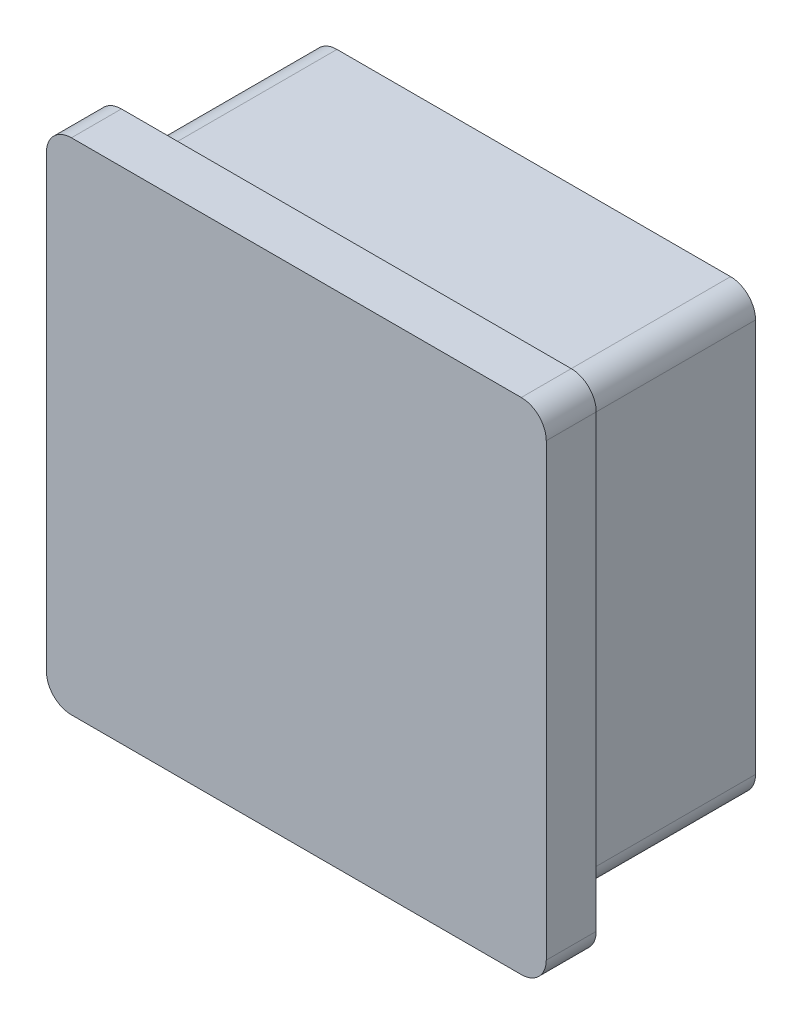
ISO-10303-21;
HEADER;
FILE_DESCRIPTION(('STEP AP214'),'2;1');
FILE_NAME('part.step','',(''),(''),'','','');
FILE_SCHEMA(('AUTOMOTIVE_DESIGN { 1 0 10303 214 1 1 1 1 }'));
ENDSEC;
DATA;
#1=APPLICATION_CONTEXT('core data for automotive mechanical design processes');
#2=APPLICATION_PROTOCOL_DEFINITION('international standard','automotive_design',2000,#1);
#3=PRODUCT_CONTEXT('',#1,'mechanical');
#4=PRODUCT('Part','Part','',(#3));
#5=PRODUCT_RELATED_PRODUCT_CATEGORY('part','',(#4));
#6=PRODUCT_DEFINITION_FORMATION('','',#4);
#7=PRODUCT_DEFINITION_CONTEXT('part definition',#1,'design');
#8=PRODUCT_DEFINITION('design','',#6,#7);
#9=PRODUCT_DEFINITION_SHAPE('','',#8);
#10=(LENGTH_UNIT() NAMED_UNIT(*) SI_UNIT(.MILLI.,.METRE.));
#11=(NAMED_UNIT(*) PLANE_ANGLE_UNIT() SI_UNIT($,.RADIAN.));
#12=(NAMED_UNIT(*) SI_UNIT($,.STERADIAN.) SOLID_ANGLE_UNIT());
#13=UNCERTAINTY_MEASURE_WITH_UNIT(LENGTH_MEASURE(1.E-05),#10,'distance_accuracy_value','');
#14=(GEOMETRIC_REPRESENTATION_CONTEXT(3) GLOBAL_UNCERTAINTY_ASSIGNED_CONTEXT((#13)) GLOBAL_UNIT_ASSIGNED_CONTEXT((#10,
#11,#12)) REPRESENTATION_CONTEXT('',''));
#15=CARTESIAN_POINT('',(0.,0.,0.));
#16=DIRECTION('',(0.,0.,1.));
#17=DIRECTION('',(1.,0.,0.));
#18=AXIS2_PLACEMENT_3D('',#15,#16,#17);
#19=CARTESIAN_POINT('',(18.,-18.,4.));
#20=DIRECTION('',(0.,0.,-1.));
#21=DIRECTION('',(-1.,0.,0.));
#22=AXIS2_PLACEMENT_3D('',#19,#20,#21);
#23=CYLINDRICAL_SURFACE('',#22,2.);
#24=CARTESIAN_POINT('',(18.,-18.,0.));
#25=DIRECTION('',(0.,0.,1.));
#26=DIRECTION('',(1.,0.,0.));
#27=AXIS2_PLACEMENT_3D('',#24,#25,#26);
#28=CIRCLE('',#27,2.);
#29=CARTESIAN_POINT('',(18.,-20.,0.));
#30=VERTEX_POINT('',#29);
#31=CARTESIAN_POINT('',(20.,-18.,0.));
#32=VERTEX_POINT('',#31);
#33=EDGE_CURVE('E438',#30,#32,#28,.T.);
#34=ORIENTED_EDGE('',*,*,#33,.T.);
#35=DIRECTION('',(0.,0.,-1.));
#36=VECTOR('',#35,1.);
#37=CARTESIAN_POINT('',(20.,-18.,4.));
#38=LINE('',#37,#36);
#39=CARTESIAN_POINT('',(20.,-18.,4.));
#40=VERTEX_POINT('',#39);
#41=EDGE_CURVE('E11',#40,#32,#38,.T.);
#42=ORIENTED_EDGE('',*,*,#41,.F.);
#43=CARTESIAN_POINT('',(18.,-18.,4.));
#44=DIRECTION('',(0.,0.,1.));
#45=DIRECTION('',(1.,0.,0.));
#46=AXIS2_PLACEMENT_3D('',#43,#44,#45);
#47=CIRCLE('',#46,2.);
#48=CARTESIAN_POINT('',(18.,-20.,4.));
#49=VERTEX_POINT('',#48);
#50=EDGE_CURVE('E479',#49,#40,#47,.T.);
#51=ORIENTED_EDGE('',*,*,#50,.F.);
#52=DIRECTION('',(0.,0.,-1.));
#53=VECTOR('',#52,1.);
#54=CARTESIAN_POINT('',(18.,-20.,4.));
#55=LINE('',#54,#53);
#56=EDGE_CURVE('E497',#49,#30,#55,.T.);
#57=ORIENTED_EDGE('',*,*,#56,.T.);
#58=EDGE_LOOP('',(#34,#42,#51,#57));
#59=FACE_BOUND('',#58,.T.);
#60=ADVANCED_FACE('F33',(#59),#23,.T.);
#61=CARTESIAN_POINT('',(20.,18.,4.));
#62=DIRECTION('',(-1.,0.,0.));
#63=DIRECTION('',(0.,-1.,0.));
#64=AXIS2_PLACEMENT_3D('',#61,#62,#63);
#65=PLANE('',#64);
#66=DIRECTION('',(0.,1.,0.));
#67=VECTOR('',#66,1.);
#68=CARTESIAN_POINT('',(20.,18.,0.));
#69=LINE('',#68,#67);
#70=CARTESIAN_POINT('',(20.,18.,0.));
#71=VERTEX_POINT('',#70);
#72=EDGE_CURVE('E500',#32,#71,#69,.T.);
#73=ORIENTED_EDGE('',*,*,#72,.T.);
#74=DIRECTION('',(0.,0.,-1.));
#75=VECTOR('',#74,1.);
#76=CARTESIAN_POINT('',(20.,18.,4.));
#77=LINE('',#76,#75);
#78=CARTESIAN_POINT('',(20.,18.,4.));
#79=VERTEX_POINT('',#78);
#80=EDGE_CURVE('E40',#79,#71,#77,.T.);
#81=ORIENTED_EDGE('',*,*,#80,.F.);
#82=DIRECTION('',(0.,1.,0.));
#83=VECTOR('',#82,1.);
#84=CARTESIAN_POINT('',(20.,18.,4.));
#85=LINE('',#84,#83);
#86=EDGE_CURVE('E482',#40,#79,#85,.T.);
#87=ORIENTED_EDGE('',*,*,#86,.F.);
#88=ORIENTED_EDGE('',*,*,#41,.T.);
#89=EDGE_LOOP('',(#73,#81,#87,#88));
#90=FACE_BOUND('',#89,.T.);
#91=ADVANCED_FACE('F557',(#90),#65,.F.);
#92=CARTESIAN_POINT('',(18.,18.,4.));
#93=DIRECTION('',(0.,0.,-1.));
#94=DIRECTION('',(-1.,0.,0.));
#95=AXIS2_PLACEMENT_3D('',#92,#93,#94);
#96=CYLINDRICAL_SURFACE('',#95,2.);
#97=CARTESIAN_POINT('',(18.,18.,0.));
#98=DIRECTION('',(0.,0.,1.));
#99=DIRECTION('',(-1.,0.,0.));
#100=AXIS2_PLACEMENT_3D('',#97,#98,#99);
#101=CIRCLE('',#100,2.);
#102=CARTESIAN_POINT('',(18.,20.,0.));
#103=VERTEX_POINT('',#102);
#104=EDGE_CURVE('E502',#71,#103,#101,.T.);
#105=ORIENTED_EDGE('',*,*,#104,.T.);
#106=DIRECTION('',(0.,0.,-1.));
#107=VECTOR('',#106,1.);
#108=CARTESIAN_POINT('',(18.,20.,4.));
#109=LINE('',#108,#107);
#110=CARTESIAN_POINT('',(18.,20.,4.));
#111=VERTEX_POINT('',#110);
#112=EDGE_CURVE('E527',#111,#103,#109,.T.);
#113=ORIENTED_EDGE('',*,*,#112,.F.);
#114=CARTESIAN_POINT('',(18.,18.,4.));
#115=DIRECTION('',(0.,0.,1.));
#116=DIRECTION('',(-1.,0.,0.));
#117=AXIS2_PLACEMENT_3D('',#114,#115,#116);
#118=CIRCLE('',#117,2.);
#119=EDGE_CURVE('E485',#79,#111,#118,.T.);
#120=ORIENTED_EDGE('',*,*,#119,.F.);
#121=ORIENTED_EDGE('',*,*,#80,.T.);
#122=EDGE_LOOP('',(#105,#113,#120,#121));
#123=FACE_BOUND('',#122,.T.);
#124=ADVANCED_FACE('F534',(#123),#96,.T.);
#125=CARTESIAN_POINT('',(-18.,20.,4.));
#126=DIRECTION('',(0.,-1.,0.));
#127=DIRECTION('',(0.,0.,-1.));
#128=AXIS2_PLACEMENT_3D('',#125,#126,#127);
#129=PLANE('',#128);
#130=DIRECTION('',(-1.,0.,0.));
#131=VECTOR('',#130,1.);
#132=CARTESIAN_POINT('',(-18.,20.,0.));
#133=LINE('',#132,#131);
#134=CARTESIAN_POINT('',(-18.,20.,0.));
#135=VERTEX_POINT('',#134);
#136=EDGE_CURVE('E504',#103,#135,#133,.T.);
#137=ORIENTED_EDGE('',*,*,#136,.T.);
#138=DIRECTION('',(0.,0.,-1.));
#139=VECTOR('',#138,1.);
#140=CARTESIAN_POINT('',(-18.,20.,4.));
#141=LINE('',#140,#139);
#142=CARTESIAN_POINT('',(-18.,20.,4.));
#143=VERTEX_POINT('',#142);
#144=EDGE_CURVE('E524',#143,#135,#141,.T.);
#145=ORIENTED_EDGE('',*,*,#144,.F.);
#146=DIRECTION('',(-1.,0.,0.));
#147=VECTOR('',#146,1.);
#148=CARTESIAN_POINT('',(-18.,20.,4.));
#149=LINE('',#148,#147);
#150=EDGE_CURVE('E487',#111,#143,#149,.T.);
#151=ORIENTED_EDGE('',*,*,#150,.F.);
#152=ORIENTED_EDGE('',*,*,#112,.T.);
#153=EDGE_LOOP('',(#137,#145,#151,#152));
#154=FACE_BOUND('',#153,.T.);
#155=ADVANCED_FACE('F545',(#154),#129,.F.);
#156=CARTESIAN_POINT('',(-18.,18.,4.));
#157=DIRECTION('',(0.,0.,-1.));
#158=DIRECTION('',(-1.,0.,0.));
#159=AXIS2_PLACEMENT_3D('',#156,#157,#158);
#160=CYLINDRICAL_SURFACE('',#159,2.);
#161=CARTESIAN_POINT('',(-18.,18.,0.));
#162=DIRECTION('',(0.,0.,1.));
#163=DIRECTION('',(1.,0.,0.));
#164=AXIS2_PLACEMENT_3D('',#161,#162,#163);
#165=CIRCLE('',#164,2.);
#166=CARTESIAN_POINT('',(-20.,18.,0.));
#167=VERTEX_POINT('',#166);
#168=EDGE_CURVE('E506',#135,#167,#165,.T.);
#169=ORIENTED_EDGE('',*,*,#168,.T.);
#170=DIRECTION('',(0.,0.,-1.));
#171=VECTOR('',#170,1.);
#172=CARTESIAN_POINT('',(-20.,18.,4.));
#173=LINE('',#172,#171);
#174=CARTESIAN_POINT('',(-20.,18.,4.));
#175=VERTEX_POINT('',#174);
#176=EDGE_CURVE('E521',#175,#167,#173,.T.);
#177=ORIENTED_EDGE('',*,*,#176,.F.);
#178=CARTESIAN_POINT('',(-18.,18.,4.));
#179=DIRECTION('',(0.,0.,1.));
#180=DIRECTION('',(1.,0.,0.));
#181=AXIS2_PLACEMENT_3D('',#178,#179,#180);
#182=CIRCLE('',#181,2.);
#183=EDGE_CURVE('E489',#143,#175,#182,.T.);
#184=ORIENTED_EDGE('',*,*,#183,.F.);
#185=ORIENTED_EDGE('',*,*,#144,.T.);
#186=EDGE_LOOP('',(#169,#177,#184,#185));
#187=FACE_BOUND('',#186,.T.);
#188=ADVANCED_FACE('F549',(#187),#160,.T.);
#189=CARTESIAN_POINT('',(-20.,18.,4.));
#190=DIRECTION('',(1.,0.,0.));
#191=DIRECTION('',(0.,1.,0.));
#192=AXIS2_PLACEMENT_3D('',#189,#190,#191);
#193=PLANE('',#192);
#194=DIRECTION('',(0.,-1.,0.));
#195=VECTOR('',#194,1.);
#196=CARTESIAN_POINT('',(-20.,18.,0.));
#197=LINE('',#196,#195);
#198=CARTESIAN_POINT('',(-20.,-18.,0.));
#199=VERTEX_POINT('',#198);
#200=EDGE_CURVE('E508',#167,#199,#197,.T.);
#201=ORIENTED_EDGE('',*,*,#200,.T.);
#202=DIRECTION('',(0.,0.,-1.));
#203=VECTOR('',#202,1.);
#204=CARTESIAN_POINT('',(-20.,-18.,4.));
#205=LINE('',#204,#203);
#206=CARTESIAN_POINT('',(-20.,-18.,4.));
#207=VERTEX_POINT('',#206);
#208=EDGE_CURVE('E518',#207,#199,#205,.T.);
#209=ORIENTED_EDGE('',*,*,#208,.F.);
#210=DIRECTION('',(0.,-1.,0.));
#211=VECTOR('',#210,1.);
#212=CARTESIAN_POINT('',(-20.,18.,4.));
#213=LINE('',#212,#211);
#214=EDGE_CURVE('E491',#175,#207,#213,.T.);
#215=ORIENTED_EDGE('',*,*,#214,.F.);
#216=ORIENTED_EDGE('',*,*,#176,.T.);
#217=EDGE_LOOP('',(#201,#209,#215,#216));
#218=FACE_BOUND('',#217,.T.);
#219=ADVANCED_FACE('F570',(#218),#193,.F.);
#220=CARTESIAN_POINT('',(-18.,-18.,4.));
#221=DIRECTION('',(0.,0.,-1.));
#222=DIRECTION('',(-1.,0.,0.));
#223=AXIS2_PLACEMENT_3D('',#220,#221,#222);
#224=CYLINDRICAL_SURFACE('',#223,2.);
#225=CARTESIAN_POINT('',(-18.,-18.,0.));
#226=DIRECTION('',(0.,0.,1.));
#227=DIRECTION('',(1.,0.,0.));
#228=AXIS2_PLACEMENT_3D('',#225,#226,#227);
#229=CIRCLE('',#228,2.);
#230=CARTESIAN_POINT('',(-18.,-20.,0.));
#231=VERTEX_POINT('',#230);
#232=EDGE_CURVE('E510',#199,#231,#229,.T.);
#233=ORIENTED_EDGE('',*,*,#232,.T.);
#234=DIRECTION('',(0.,0.,-1.));
#235=VECTOR('',#234,1.);
#236=CARTESIAN_POINT('',(-18.,-20.,4.));
#237=LINE('',#236,#235);
#238=CARTESIAN_POINT('',(-18.,-20.,4.));
#239=VERTEX_POINT('',#238);
#240=EDGE_CURVE('E515',#239,#231,#237,.T.);
#241=ORIENTED_EDGE('',*,*,#240,.F.);
#242=CARTESIAN_POINT('',(-18.,-18.,4.));
#243=DIRECTION('',(0.,0.,1.));
#244=DIRECTION('',(1.,0.,0.));
#245=AXIS2_PLACEMENT_3D('',#242,#243,#244);
#246=CIRCLE('',#245,2.);
#247=EDGE_CURVE('E493',#207,#239,#246,.T.);
#248=ORIENTED_EDGE('',*,*,#247,.F.);
#249=ORIENTED_EDGE('',*,*,#208,.T.);
#250=EDGE_LOOP('',(#233,#241,#248,#249));
#251=FACE_BOUND('',#250,.T.);
#252=ADVANCED_FACE('F568',(#251),#224,.T.);
#253=CARTESIAN_POINT('',(-18.,-20.,4.));
#254=DIRECTION('',(0.,1.,0.));
#255=DIRECTION('',(0.,0.,1.));
#256=AXIS2_PLACEMENT_3D('',#253,#254,#255);
#257=PLANE('',#256);
#258=DIRECTION('',(1.,0.,0.));
#259=VECTOR('',#258,1.);
#260=CARTESIAN_POINT('',(-18.,-20.,0.));
#261=LINE('',#260,#259);
#262=EDGE_CURVE('E483',#231,#30,#261,.T.);
#263=ORIENTED_EDGE('',*,*,#262,.T.);
#264=ORIENTED_EDGE('',*,*,#56,.F.);
#265=DIRECTION('',(1.,0.,0.));
#266=VECTOR('',#265,1.);
#267=CARTESIAN_POINT('',(-18.,-20.,4.));
#268=LINE('',#267,#266);
#269=EDGE_CURVE('E495',#239,#49,#268,.T.);
#270=ORIENTED_EDGE('',*,*,#269,.F.);
#271=ORIENTED_EDGE('',*,*,#240,.T.);
#272=EDGE_LOOP('',(#263,#264,#270,#271));
#273=FACE_BOUND('',#272,.T.);
#274=ADVANCED_FACE('F563',(#273),#257,.F.);
#275=CARTESIAN_POINT('',(18.,-18.,4.));
#276=DIRECTION('',(0.,0.,1.));
#277=DIRECTION('',(1.,0.,0.));
#278=AXIS2_PLACEMENT_3D('',#275,#276,#277);
#279=PLANE('',#278);
#280=ORIENTED_EDGE('',*,*,#50,.T.);
#281=ORIENTED_EDGE('',*,*,#86,.T.);
#282=ORIENTED_EDGE('',*,*,#119,.T.);
#283=ORIENTED_EDGE('',*,*,#150,.T.);
#284=ORIENTED_EDGE('',*,*,#183,.T.);
#285=ORIENTED_EDGE('',*,*,#214,.T.);
#286=ORIENTED_EDGE('',*,*,#247,.T.);
#287=ORIENTED_EDGE('',*,*,#269,.T.);
#288=EDGE_LOOP('',(#280,#281,#282,#283,#284,#285,#286,#287));
#289=FACE_BOUND('',#288,.T.);
#290=ADVANCED_FACE('F553',(#289),#279,.T.);
#291=CARTESIAN_POINT('',(18.,-18.,0.));
#292=DIRECTION('',(0.,0.,1.));
#293=DIRECTION('',(1.,0.,0.));
#294=AXIS2_PLACEMENT_3D('',#291,#292,#293);
#295=PLANE('',#294);
#296=DIRECTION('',(0.,-1.,0.));
#297=VECTOR('',#296,1.);
#298=CARTESIAN_POINT('',(17.75,0.,0.));
#299=LINE('',#298,#297);
#300=CARTESIAN_POINT('',(17.75,15.75,0.));
#301=VERTEX_POINT('',#300);
#302=CARTESIAN_POINT('',(17.75,-15.75,0.));
#303=VERTEX_POINT('',#302);
#304=EDGE_CURVE('E55',#301,#303,#299,.T.);
#305=ORIENTED_EDGE('',*,*,#304,.F.);
#306=CARTESIAN_POINT('',(15.75,15.75,0.));
#307=DIRECTION('',(0.,0.,-1.));
#308=DIRECTION('',(-1.,0.,0.));
#309=AXIS2_PLACEMENT_3D('',#306,#307,#308);
#310=CIRCLE('',#309,2.);
#311=CARTESIAN_POINT('',(15.75,17.75,0.));
#312=VERTEX_POINT('',#311);
#313=EDGE_CURVE('E401',#301,#312,#310,.F.);
#314=ORIENTED_EDGE('',*,*,#313,.T.);
#315=DIRECTION('',(1.,0.,0.));
#316=VECTOR('',#315,1.);
#317=CARTESIAN_POINT('',(0.,17.75,0.));
#318=LINE('',#317,#316);
#319=CARTESIAN_POINT('',(-15.75,17.75,0.));
#320=VERTEX_POINT('',#319);
#321=EDGE_CURVE('E291',#320,#312,#318,.T.);
#322=ORIENTED_EDGE('',*,*,#321,.F.);
#323=CARTESIAN_POINT('',(-15.75,15.75,0.));
#324=DIRECTION('',(0.,0.,-1.));
#325=DIRECTION('',(-1.,0.,0.));
#326=AXIS2_PLACEMENT_3D('',#323,#324,#325);
#327=CIRCLE('',#326,2.);
#328=CARTESIAN_POINT('',(-17.75,15.75,0.));
#329=VERTEX_POINT('',#328);
#330=EDGE_CURVE('E294',#329,#320,#327,.T.);
#331=ORIENTED_EDGE('',*,*,#330,.F.);
#332=DIRECTION('',(0.,-1.,0.));
#333=VECTOR('',#332,1.);
#334=CARTESIAN_POINT('',(-17.75,0.,0.));
#335=LINE('',#334,#333);
#336=CARTESIAN_POINT('',(-17.75,-15.75,0.));
#337=VERTEX_POINT('',#336);
#338=EDGE_CURVE('E412',#329,#337,#335,.T.);
#339=ORIENTED_EDGE('',*,*,#338,.T.);
#340=CARTESIAN_POINT('',(-15.75,-15.75,0.));
#341=DIRECTION('',(0.,0.,-1.));
#342=DIRECTION('',(-1.,0.,0.));
#343=AXIS2_PLACEMENT_3D('',#340,#341,#342);
#344=CIRCLE('',#343,2.);
#345=CARTESIAN_POINT('',(-15.75,-17.75,0.));
#346=VERTEX_POINT('',#345);
#347=EDGE_CURVE('E409',#346,#337,#344,.T.);
#348=ORIENTED_EDGE('',*,*,#347,.F.);
#349=DIRECTION('',(1.,0.,0.));
#350=VECTOR('',#349,1.);
#351=CARTESIAN_POINT('',(0.,-17.75,0.));
#352=LINE('',#351,#350);
#353=CARTESIAN_POINT('',(15.75,-17.75,0.));
#354=VERTEX_POINT('',#353);
#355=EDGE_CURVE('E407',#346,#354,#352,.T.);
#356=ORIENTED_EDGE('',*,*,#355,.T.);
#357=CARTESIAN_POINT('',(15.75,-15.75,0.));
#358=DIRECTION('',(0.,0.,-1.));
#359=DIRECTION('',(-1.,0.,0.));
#360=AXIS2_PLACEMENT_3D('',#357,#358,#359);
#361=CIRCLE('',#360,2.);
#362=EDGE_CURVE('E404',#303,#354,#361,.T.);
#363=ORIENTED_EDGE('',*,*,#362,.F.);
#364=EDGE_LOOP('',(#305,#314,#322,#331,#339,#348,#356,#363));
#365=FACE_BOUND('',#364,.T.);
#366=ORIENTED_EDGE('',*,*,#33,.F.);
#367=ORIENTED_EDGE('',*,*,#262,.F.);
#368=ORIENTED_EDGE('',*,*,#232,.F.);
#369=ORIENTED_EDGE('',*,*,#200,.F.);
#370=ORIENTED_EDGE('',*,*,#168,.F.);
#371=ORIENTED_EDGE('',*,*,#136,.F.);
#372=ORIENTED_EDGE('',*,*,#104,.F.);
#373=ORIENTED_EDGE('',*,*,#72,.F.);
#374=EDGE_LOOP('',(#366,#367,#368,#369,#370,#371,#372,#373));
#375=FACE_BOUND('',#374,.T.);
#376=ADVANCED_FACE('F540',(#365,#375),#295,.F.);
#377=CARTESIAN_POINT('',(15.75,15.75,-15.));
#378=DIRECTION('',(0.,0.,1.));
#379=DIRECTION('',(1.,0.,0.));
#380=AXIS2_PLACEMENT_3D('',#377,#378,#379);
#381=CYLINDRICAL_SURFACE('',#380,2.);
#382=ORIENTED_EDGE('',*,*,#313,.F.);
#383=DIRECTION('',(0.,0.,1.));
#384=VECTOR('',#383,1.);
#385=CARTESIAN_POINT('',(17.75,15.75,-15.));
#386=LINE('',#385,#384);
#387=CARTESIAN_POINT('',(17.75,15.75,-15.));
#388=VERTEX_POINT('',#387);
#389=EDGE_CURVE('E436',#388,#301,#386,.T.);
#390=ORIENTED_EDGE('',*,*,#389,.F.);
#391=CARTESIAN_POINT('',(15.75,15.75,-15.));
#392=DIRECTION('',(0.,0.,-1.));
#393=DIRECTION('',(-1.,0.,0.));
#394=AXIS2_PLACEMENT_3D('',#391,#392,#393);
#395=CIRCLE('',#394,2.);
#396=CARTESIAN_POINT('',(15.75,17.75,-15.));
#397=VERTEX_POINT('',#396);
#398=EDGE_CURVE('E334',#388,#397,#395,.F.);
#399=ORIENTED_EDGE('',*,*,#398,.T.);
#400=DIRECTION('',(0.,0.,1.));
#401=VECTOR('',#400,1.);
#402=CARTESIAN_POINT('',(15.75,17.75,-15.));
#403=LINE('',#402,#401);
#404=EDGE_CURVE('E275',#397,#312,#403,.T.);
#405=ORIENTED_EDGE('',*,*,#404,.T.);
#406=EDGE_LOOP('',(#382,#390,#399,#405));
#407=FACE_BOUND('',#406,.T.);
#408=ADVANCED_FACE('F632',(#407),#381,.T.);
#409=CARTESIAN_POINT('',(17.75,0.,-15.));
#410=DIRECTION('',(-1.,0.,0.));
#411=DIRECTION('',(0.,-1.,0.));
#412=AXIS2_PLACEMENT_3D('',#409,#410,#411);
#413=PLANE('',#412);
#414=ORIENTED_EDGE('',*,*,#304,.T.);
#415=DIRECTION('',(0.,0.,1.));
#416=VECTOR('',#415,1.);
#417=CARTESIAN_POINT('',(17.75,-15.75,-15.));
#418=LINE('',#417,#416);
#419=CARTESIAN_POINT('',(17.75,-15.75,-15.));
#420=VERTEX_POINT('',#419);
#421=EDGE_CURVE('E433',#420,#303,#418,.T.);
#422=ORIENTED_EDGE('',*,*,#421,.F.);
#423=DIRECTION('',(0.,-1.,0.));
#424=VECTOR('',#423,1.);
#425=CARTESIAN_POINT('',(17.75,0.,-15.));
#426=LINE('',#425,#424);
#427=EDGE_CURVE('E337',#388,#420,#426,.T.);
#428=ORIENTED_EDGE('',*,*,#427,.F.);
#429=ORIENTED_EDGE('',*,*,#389,.T.);
#430=EDGE_LOOP('',(#414,#422,#428,#429));
#431=FACE_BOUND('',#430,.T.);
#432=ADVANCED_FACE('F643',(#431),#413,.F.);
#433=CARTESIAN_POINT('',(15.75,-15.75,-15.));
#434=DIRECTION('',(0.,0.,1.));
#435=DIRECTION('',(1.,0.,0.));
#436=AXIS2_PLACEMENT_3D('',#433,#434,#435);
#437=CYLINDRICAL_SURFACE('',#436,2.);
#438=ORIENTED_EDGE('',*,*,#362,.T.);
#439=DIRECTION('',(0.,0.,1.));
#440=VECTOR('',#439,1.);
#441=CARTESIAN_POINT('',(15.75,-17.75,-15.));
#442=LINE('',#441,#440);
#443=CARTESIAN_POINT('',(15.75,-17.75,-15.));
#444=VERTEX_POINT('',#443);
#445=EDGE_CURVE('E430',#444,#354,#442,.T.);
#446=ORIENTED_EDGE('',*,*,#445,.F.);
#447=CARTESIAN_POINT('',(15.75,-15.75,-15.));
#448=DIRECTION('',(0.,0.,-1.));
#449=DIRECTION('',(-1.,0.,0.));
#450=AXIS2_PLACEMENT_3D('',#447,#448,#449);
#451=CIRCLE('',#450,2.);
#452=EDGE_CURVE('E340',#420,#444,#451,.T.);
#453=ORIENTED_EDGE('',*,*,#452,.F.);
#454=ORIENTED_EDGE('',*,*,#421,.T.);
#455=EDGE_LOOP('',(#438,#446,#453,#454));
#456=FACE_BOUND('',#455,.T.);
#457=ADVANCED_FACE('F653',(#456),#437,.T.);
#458=CARTESIAN_POINT('',(0.,-17.75,-15.));
#459=DIRECTION('',(0.,-1.,0.));
#460=DIRECTION('',(1.,0.,0.));
#461=AXIS2_PLACEMENT_3D('',#458,#459,#460);
#462=PLANE('',#461);
#463=ORIENTED_EDGE('',*,*,#355,.F.);
#464=DIRECTION('',(0.,0.,1.));
#465=VECTOR('',#464,1.);
#466=CARTESIAN_POINT('',(-15.75,-17.75,-15.));
#467=LINE('',#466,#465);
#468=CARTESIAN_POINT('',(-15.75,-17.75,-15.));
#469=VERTEX_POINT('',#468);
#470=EDGE_CURVE('E427',#469,#346,#467,.T.);
#471=ORIENTED_EDGE('',*,*,#470,.F.);
#472=DIRECTION('',(1.,0.,0.));
#473=VECTOR('',#472,1.);
#474=CARTESIAN_POINT('',(0.,-17.75,-15.));
#475=LINE('',#474,#473);
#476=EDGE_CURVE('E342',#469,#444,#475,.T.);
#477=ORIENTED_EDGE('',*,*,#476,.T.);
#478=ORIENTED_EDGE('',*,*,#445,.T.);
#479=EDGE_LOOP('',(#463,#471,#477,#478));
#480=FACE_BOUND('',#479,.T.);
#481=ADVANCED_FACE('F663',(#480),#462,.T.);
#482=CARTESIAN_POINT('',(-15.75,-15.75,-15.));
#483=DIRECTION('',(0.,0.,1.));
#484=DIRECTION('',(1.,0.,0.));
#485=AXIS2_PLACEMENT_3D('',#482,#483,#484);
#486=CYLINDRICAL_SURFACE('',#485,2.);
#487=ORIENTED_EDGE('',*,*,#347,.T.);
#488=DIRECTION('',(0.,0.,1.));
#489=VECTOR('',#488,1.);
#490=CARTESIAN_POINT('',(-17.75,-15.75,-15.));
#491=LINE('',#490,#489);
#492=CARTESIAN_POINT('',(-17.75,-15.75,-15.));
#493=VERTEX_POINT('',#492);
#494=EDGE_CURVE('E424',#493,#337,#491,.T.);
#495=ORIENTED_EDGE('',*,*,#494,.F.);
#496=CARTESIAN_POINT('',(-15.75,-15.75,-15.));
#497=DIRECTION('',(0.,0.,-1.));
#498=DIRECTION('',(-1.,0.,0.));
#499=AXIS2_PLACEMENT_3D('',#496,#497,#498);
#500=CIRCLE('',#499,2.);
#501=EDGE_CURVE('E345',#469,#493,#500,.T.);
#502=ORIENTED_EDGE('',*,*,#501,.F.);
#503=ORIENTED_EDGE('',*,*,#470,.T.);
#504=EDGE_LOOP('',(#487,#495,#502,#503));
#505=FACE_BOUND('',#504,.T.);
#506=ADVANCED_FACE('F673',(#505),#486,.T.);
#507=CARTESIAN_POINT('',(-17.75,0.,-15.));
#508=DIRECTION('',(-1.,0.,0.));
#509=DIRECTION('',(0.,-1.,0.));
#510=AXIS2_PLACEMENT_3D('',#507,#508,#509);
#511=PLANE('',#510);
#512=ORIENTED_EDGE('',*,*,#338,.F.);
#513=DIRECTION('',(0.,0.,1.));
#514=VECTOR('',#513,1.);
#515=CARTESIAN_POINT('',(-17.75,15.75,-15.));
#516=LINE('',#515,#514);
#517=CARTESIAN_POINT('',(-17.75,15.75,-15.));
#518=VERTEX_POINT('',#517);
#519=EDGE_CURVE('E421',#518,#329,#516,.T.);
#520=ORIENTED_EDGE('',*,*,#519,.F.);
#521=DIRECTION('',(0.,-1.,0.));
#522=VECTOR('',#521,1.);
#523=CARTESIAN_POINT('',(-17.75,0.,-15.));
#524=LINE('',#523,#522);
#525=EDGE_CURVE('E347',#518,#493,#524,.T.);
#526=ORIENTED_EDGE('',*,*,#525,.T.);
#527=ORIENTED_EDGE('',*,*,#494,.T.);
#528=EDGE_LOOP('',(#512,#520,#526,#527));
#529=FACE_BOUND('',#528,.T.);
#530=ADVANCED_FACE('F683',(#529),#511,.T.);
#531=CARTESIAN_POINT('',(-15.75,15.75,-15.));
#532=DIRECTION('',(0.,0.,1.));
#533=DIRECTION('',(1.,0.,0.));
#534=AXIS2_PLACEMENT_3D('',#531,#532,#533);
#535=CYLINDRICAL_SURFACE('',#534,2.);
#536=ORIENTED_EDGE('',*,*,#330,.T.);
#537=DIRECTION('',(0.,0.,1.));
#538=VECTOR('',#537,1.);
#539=CARTESIAN_POINT('',(-15.75,17.75,-15.));
#540=LINE('',#539,#538);
#541=CARTESIAN_POINT('',(-15.75,17.75,-15.));
#542=VERTEX_POINT('',#541);
#543=EDGE_CURVE('E418',#542,#320,#540,.T.);
#544=ORIENTED_EDGE('',*,*,#543,.F.);
#545=CARTESIAN_POINT('',(-15.75,15.75,-15.));
#546=DIRECTION('',(0.,0.,-1.));
#547=DIRECTION('',(-1.,0.,0.));
#548=AXIS2_PLACEMENT_3D('',#545,#546,#547);
#549=CIRCLE('',#548,2.);
#550=EDGE_CURVE('E350',#518,#542,#549,.T.);
#551=ORIENTED_EDGE('',*,*,#550,.F.);
#552=ORIENTED_EDGE('',*,*,#519,.T.);
#553=EDGE_LOOP('',(#536,#544,#551,#552));
#554=FACE_BOUND('',#553,.T.);
#555=ADVANCED_FACE('F693',(#554),#535,.T.);
#556=CARTESIAN_POINT('',(3.99999999999997,0.,-15.));
#557=DIRECTION('',(1.,0.,0.));
#558=DIRECTION('',(0.,1.,0.));
#559=AXIS2_PLACEMENT_3D('',#556,#557,#558);
#560=PLANE('',#559);
#561=DIRECTION('',(0.,1.,0.));
#562=VECTOR('',#561,1.);
#563=CARTESIAN_POINT('',(3.99999999999997,0.,0.));
#564=LINE('',#563,#562);
#565=CARTESIAN_POINT('',(3.99999999999994,11.25,0.));
#566=VERTEX_POINT('',#565);
#567=CARTESIAN_POINT('',(3.99999999999993,15.25,0.));
#568=VERTEX_POINT('',#567);
#569=EDGE_CURVE('E272',#566,#568,#564,.T.);
#570=ORIENTED_EDGE('',*,*,#569,.F.);
#571=DIRECTION('',(0.,0.,1.));
#572=VECTOR('',#571,1.);
#573=CARTESIAN_POINT('',(3.99999999999994,11.25,-15.));
#574=LINE('',#573,#572);
#575=CARTESIAN_POINT('',(3.99999999999994,11.25,-15.));
#576=VERTEX_POINT('',#575);
#577=EDGE_CURVE('E265',#576,#566,#574,.T.);
#578=ORIENTED_EDGE('',*,*,#577,.F.);
#579=DIRECTION('',(0.,1.,0.));
#580=VECTOR('',#579,1.);
#581=CARTESIAN_POINT('',(3.99999999999997,0.,-15.));
#582=LINE('',#581,#580);
#583=CARTESIAN_POINT('',(3.99999999999993,15.25,-15.));
#584=VERTEX_POINT('',#583);
#585=EDGE_CURVE('E269',#576,#584,#582,.T.);
#586=ORIENTED_EDGE('',*,*,#585,.T.);
#587=DIRECTION('',(0.,0.,1.));
#588=VECTOR('',#587,1.);
#589=CARTESIAN_POINT('',(3.99999999999993,15.25,-15.));
#590=LINE('',#589,#588);
#591=EDGE_CURVE('E355',#584,#568,#590,.T.);
#592=ORIENTED_EDGE('',*,*,#591,.T.);
#593=EDGE_LOOP('',(#570,#578,#586,#592));
#594=FACE_BOUND('',#593,.T.);
#595=ADVANCED_FACE('F267',(#594),#560,.T.);
#596=CARTESIAN_POINT('',(0.,11.25,-15.));
#597=DIRECTION('',(0.,1.,0.));
#598=DIRECTION('',(-1.,0.,0.));
#599=AXIS2_PLACEMENT_3D('',#596,#597,#598);
#600=PLANE('',#599);
#601=DIRECTION('',(-1.,0.,0.));
#602=VECTOR('',#601,1.);
#603=CARTESIAN_POINT('',(0.,11.25,0.));
#604=LINE('',#603,#602);
#605=CARTESIAN_POINT('',(-4.00000000000004,11.25,0.));
#606=VERTEX_POINT('',#605);
#607=EDGE_CURVE('E357',#566,#606,#604,.T.);
#608=ORIENTED_EDGE('',*,*,#607,.T.);
#609=DIRECTION('',(0.,0.,1.));
#610=VECTOR('',#609,1.);
#611=CARTESIAN_POINT('',(-4.00000000000004,11.25,-15.));
#612=LINE('',#611,#610);
#613=CARTESIAN_POINT('',(-4.00000000000004,11.25,-15.));
#614=VERTEX_POINT('',#613);
#615=EDGE_CURVE('E276',#614,#606,#612,.T.);
#616=ORIENTED_EDGE('',*,*,#615,.F.);
#617=DIRECTION('',(-1.,0.,0.));
#618=VECTOR('',#617,1.);
#619=CARTESIAN_POINT('',(0.,11.25,-15.));
#620=LINE('',#619,#618);
#621=EDGE_CURVE('E279',#576,#614,#620,.T.);
#622=ORIENTED_EDGE('',*,*,#621,.F.);
#623=ORIENTED_EDGE('',*,*,#577,.T.);
#624=EDGE_LOOP('',(#608,#616,#622,#623));
#625=FACE_BOUND('',#624,.T.);
#626=ADVANCED_FACE('F280',(#625),#600,.F.);
#627=CARTESIAN_POINT('',(-4.,0.,-15.));
#628=DIRECTION('',(1.,0.,0.));
#629=DIRECTION('',(0.,1.,0.));
#630=AXIS2_PLACEMENT_3D('',#627,#628,#629);
#631=PLANE('',#630);
#632=DIRECTION('',(0.,1.,0.));
#633=VECTOR('',#632,1.);
#634=CARTESIAN_POINT('',(-4.,0.,0.));
#635=LINE('',#634,#633);
#636=CARTESIAN_POINT('',(-4.00000000000004,15.25,0.));
#637=VERTEX_POINT('',#636);
#638=EDGE_CURVE('E359',#606,#637,#635,.T.);
#639=ORIENTED_EDGE('',*,*,#638,.T.);
#640=DIRECTION('',(0.,0.,1.));
#641=VECTOR('',#640,1.);
#642=CARTESIAN_POINT('',(-4.00000000000004,15.25,-15.));
#643=LINE('',#642,#641);
#644=CARTESIAN_POINT('',(-4.00000000000004,15.25,-15.));
#645=VERTEX_POINT('',#644);
#646=EDGE_CURVE('E476',#645,#637,#643,.T.);
#647=ORIENTED_EDGE('',*,*,#646,.F.);
#648=DIRECTION('',(0.,1.,0.));
#649=VECTOR('',#648,1.);
#650=CARTESIAN_POINT('',(-4.,0.,-15.));
#651=LINE('',#650,#649);
#652=EDGE_CURVE('E284',#614,#645,#651,.T.);
#653=ORIENTED_EDGE('',*,*,#652,.F.);
#654=ORIENTED_EDGE('',*,*,#615,.T.);
#655=EDGE_LOOP('',(#639,#647,#653,#654));
#656=FACE_BOUND('',#655,.T.);
#657=ADVANCED_FACE('F721',(#656),#631,.F.);
#658=CARTESIAN_POINT('',(0.,15.25,-15.));
#659=DIRECTION('',(0.,-1.,0.));
#660=DIRECTION('',(1.,0.,0.));
#661=AXIS2_PLACEMENT_3D('',#658,#659,#660);
#662=PLANE('',#661);
#663=DIRECTION('',(1.,0.,0.));
#664=VECTOR('',#663,1.);
#665=CARTESIAN_POINT('',(0.,15.25,0.));
#666=LINE('',#665,#664);
#667=CARTESIAN_POINT('',(-15.25,15.25,0.));
#668=VERTEX_POINT('',#667);
#669=EDGE_CURVE('E362',#668,#637,#666,.T.);
#670=ORIENTED_EDGE('',*,*,#669,.F.);
#671=DIRECTION('',(0.,0.,1.));
#672=VECTOR('',#671,1.);
#673=CARTESIAN_POINT('',(-15.25,15.25,-15.));
#674=LINE('',#673,#672);
#675=CARTESIAN_POINT('',(-15.25,15.25,-15.));
#676=VERTEX_POINT('',#675);
#677=EDGE_CURVE('E474',#676,#668,#674,.T.);
#678=ORIENTED_EDGE('',*,*,#677,.F.);
#679=DIRECTION('',(1.,0.,0.));
#680=VECTOR('',#679,1.);
#681=CARTESIAN_POINT('',(0.,15.25,-15.));
#682=LINE('',#681,#680);
#683=EDGE_CURVE('E298',#676,#645,#682,.T.);
#684=ORIENTED_EDGE('',*,*,#683,.T.);
#685=ORIENTED_EDGE('',*,*,#646,.T.);
#686=EDGE_LOOP('',(#670,#678,#684,#685));
#687=FACE_BOUND('',#686,.T.);
#688=ADVANCED_FACE('F730',(#687),#662,.T.);
#689=CARTESIAN_POINT('',(-15.25,0.,-15.));
#690=DIRECTION('',(-1.,0.,0.));
#691=DIRECTION('',(0.,-1.,0.));
#692=AXIS2_PLACEMENT_3D('',#689,#690,#691);
#693=PLANE('',#692);
#694=DIRECTION('',(0.,-1.,0.));
#695=VECTOR('',#694,1.);
#696=CARTESIAN_POINT('',(-15.25,0.,0.));
#697=LINE('',#696,#695);
#698=CARTESIAN_POINT('',(-15.25,3.99999999999989,0.));
#699=VERTEX_POINT('',#698);
#700=EDGE_CURVE('E365',#668,#699,#697,.T.);
#701=ORIENTED_EDGE('',*,*,#700,.T.);
#702=DIRECTION('',(0.,0.,1.));
#703=VECTOR('',#702,1.);
#704=CARTESIAN_POINT('',(-15.25,3.99999999999989,-15.));
#705=LINE('',#704,#703);
#706=CARTESIAN_POINT('',(-15.25,3.99999999999989,-15.));
#707=VERTEX_POINT('',#706);
#708=EDGE_CURVE('E472',#707,#699,#705,.T.);
#709=ORIENTED_EDGE('',*,*,#708,.F.);
#710=DIRECTION('',(0.,-1.,0.));
#711=VECTOR('',#710,1.);
#712=CARTESIAN_POINT('',(-15.25,0.,-15.));
#713=LINE('',#712,#711);
#714=EDGE_CURVE('E301',#676,#707,#713,.T.);
#715=ORIENTED_EDGE('',*,*,#714,.F.);
#716=ORIENTED_EDGE('',*,*,#677,.T.);
#717=EDGE_LOOP('',(#701,#709,#715,#716));
#718=FACE_BOUND('',#717,.T.);
#719=ADVANCED_FACE('F740',(#718),#693,.F.);
#720=CARTESIAN_POINT('',(0.,3.99999999999997,-15.));
#721=DIRECTION('',(0.,1.,0.));
#722=DIRECTION('',(-1.,0.,0.));
#723=AXIS2_PLACEMENT_3D('',#720,#721,#722);
#724=PLANE('',#723);
#725=DIRECTION('',(-1.,0.,0.));
#726=VECTOR('',#725,1.);
#727=CARTESIAN_POINT('',(0.,3.99999999999997,0.));
#728=LINE('',#727,#726);
#729=CARTESIAN_POINT('',(-11.25,3.9999999999999,0.));
#730=VERTEX_POINT('',#729);
#731=EDGE_CURVE('E369',#730,#699,#728,.T.);
#732=ORIENTED_EDGE('',*,*,#731,.F.);
#733=DIRECTION('',(0.,0.,1.));
#734=VECTOR('',#733,1.);
#735=CARTESIAN_POINT('',(-11.25,3.9999999999999,-15.));
#736=LINE('',#735,#734);
#737=CARTESIAN_POINT('',(-11.25,3.9999999999999,-15.));
#738=VERTEX_POINT('',#737);
#739=EDGE_CURVE('E470',#738,#730,#736,.T.);
#740=ORIENTED_EDGE('',*,*,#739,.F.);
#741=DIRECTION('',(-1.,0.,0.));
#742=VECTOR('',#741,1.);
#743=CARTESIAN_POINT('',(0.,3.99999999999997,-15.));
#744=LINE('',#743,#742);
#745=EDGE_CURVE('E303',#738,#707,#744,.T.);
#746=ORIENTED_EDGE('',*,*,#745,.T.);
#747=ORIENTED_EDGE('',*,*,#708,.T.);
#748=EDGE_LOOP('',(#732,#740,#746,#747));
#749=FACE_BOUND('',#748,.T.);
#750=ADVANCED_FACE('F751',(#749),#724,.T.);
#751=CARTESIAN_POINT('',(-11.25,0.,-15.));
#752=DIRECTION('',(1.,0.,0.));
#753=DIRECTION('',(0.,1.,0.));
#754=AXIS2_PLACEMENT_3D('',#751,#752,#753);
#755=PLANE('',#754);
#756=DIRECTION('',(0.,1.,0.));
#757=VECTOR('',#756,1.);
#758=CARTESIAN_POINT('',(-11.25,0.,0.));
#759=LINE('',#758,#757);
#760=CARTESIAN_POINT('',(-11.25,-4.00000000000008,0.));
#761=VERTEX_POINT('',#760);
#762=EDGE_CURVE('E373',#761,#730,#759,.T.);
#763=ORIENTED_EDGE('',*,*,#762,.F.);
#764=DIRECTION('',(0.,0.,1.));
#765=VECTOR('',#764,1.);
#766=CARTESIAN_POINT('',(-11.25,-4.00000000000008,-15.));
#767=LINE('',#766,#765);
#768=CARTESIAN_POINT('',(-11.25,-4.00000000000008,-15.));
#769=VERTEX_POINT('',#768);
#770=EDGE_CURVE('E468',#769,#761,#767,.T.);
#771=ORIENTED_EDGE('',*,*,#770,.F.);
#772=DIRECTION('',(0.,1.,0.));
#773=VECTOR('',#772,1.);
#774=CARTESIAN_POINT('',(-11.25,0.,-15.));
#775=LINE('',#774,#773);
#776=EDGE_CURVE('E307',#769,#738,#775,.T.);
#777=ORIENTED_EDGE('',*,*,#776,.T.);
#778=ORIENTED_EDGE('',*,*,#739,.T.);
#779=EDGE_LOOP('',(#763,#771,#777,#778));
#780=FACE_BOUND('',#779,.T.);
#781=ADVANCED_FACE('F762',(#780),#755,.T.);
#782=CARTESIAN_POINT('',(0.,-4.,-15.));
#783=DIRECTION('',(0.,1.,0.));
#784=DIRECTION('',(-1.,0.,0.));
#785=AXIS2_PLACEMENT_3D('',#782,#783,#784);
#786=PLANE('',#785);
#787=DIRECTION('',(-1.,0.,0.));
#788=VECTOR('',#787,1.);
#789=CARTESIAN_POINT('',(0.,-4.,0.));
#790=LINE('',#789,#788);
#791=CARTESIAN_POINT('',(-15.25,-4.00000000000009,0.));
#792=VERTEX_POINT('',#791);
#793=EDGE_CURVE('E376',#761,#792,#790,.T.);
#794=ORIENTED_EDGE('',*,*,#793,.T.);
#795=DIRECTION('',(0.,0.,1.));
#796=VECTOR('',#795,1.);
#797=CARTESIAN_POINT('',(-15.25,-4.00000000000009,-15.));
#798=LINE('',#797,#796);
#799=CARTESIAN_POINT('',(-15.25,-4.00000000000009,-15.));
#800=VERTEX_POINT('',#799);
#801=EDGE_CURVE('E465',#800,#792,#798,.T.);
#802=ORIENTED_EDGE('',*,*,#801,.F.);
#803=DIRECTION('',(-1.,0.,0.));
#804=VECTOR('',#803,1.);
#805=CARTESIAN_POINT('',(0.,-4.,-15.));
#806=LINE('',#805,#804);
#807=EDGE_CURVE('E310',#769,#800,#806,.T.);
#808=ORIENTED_EDGE('',*,*,#807,.F.);
#809=ORIENTED_EDGE('',*,*,#770,.T.);
#810=EDGE_LOOP('',(#794,#802,#808,#809));
#811=FACE_BOUND('',#810,.T.);
#812=ADVANCED_FACE('F773',(#811),#786,.F.);
#813=CARTESIAN_POINT('',(-15.25,-15.25,0.));
#814=VERTEX_POINT('',#813);
#815=EDGE_CURVE('E370',#792,#814,#697,.T.);
#816=ORIENTED_EDGE('',*,*,#815,.T.);
#817=DIRECTION('',(0.,0.,1.));
#818=VECTOR('',#817,1.);
#819=CARTESIAN_POINT('',(-15.25,-15.25,-15.));
#820=LINE('',#819,#818);
#821=CARTESIAN_POINT('',(-15.25,-15.25,-15.));
#822=VERTEX_POINT('',#821);
#823=EDGE_CURVE('E462',#822,#814,#820,.T.);
#824=ORIENTED_EDGE('',*,*,#823,.F.);
#825=EDGE_CURVE('E304',#800,#822,#713,.T.);
#826=ORIENTED_EDGE('',*,*,#825,.F.);
#827=ORIENTED_EDGE('',*,*,#801,.T.);
#828=EDGE_LOOP('',(#816,#824,#826,#827));
#829=FACE_BOUND('',#828,.T.);
#830=ADVANCED_FACE('F754',(#829),#693,.F.);
#831=CARTESIAN_POINT('',(0.,-15.25,-15.));
#832=DIRECTION('',(0.,-1.,0.));
#833=DIRECTION('',(1.,0.,0.));
#834=AXIS2_PLACEMENT_3D('',#831,#832,#833);
#835=PLANE('',#834);
#836=DIRECTION('',(1.,0.,0.));
#837=VECTOR('',#836,1.);
#838=CARTESIAN_POINT('',(0.,-15.25,0.));
#839=LINE('',#838,#837);
#840=CARTESIAN_POINT('',(-3.99999999999984,-15.25,0.));
#841=VERTEX_POINT('',#840);
#842=EDGE_CURVE('E378',#814,#841,#839,.T.);
#843=ORIENTED_EDGE('',*,*,#842,.T.);
#844=DIRECTION('',(0.,0.,1.));
#845=VECTOR('',#844,1.);
#846=CARTESIAN_POINT('',(-3.99999999999984,-15.25,-15.));
#847=LINE('',#846,#845);
#848=CARTESIAN_POINT('',(-3.99999999999984,-15.25,-15.));
#849=VERTEX_POINT('',#848);
#850=EDGE_CURVE('E460',#849,#841,#847,.T.);
#851=ORIENTED_EDGE('',*,*,#850,.F.);
#852=DIRECTION('',(1.,0.,0.));
#853=VECTOR('',#852,1.);
#854=CARTESIAN_POINT('',(0.,-15.25,-15.));
#855=LINE('',#854,#853);
#856=EDGE_CURVE('E312',#822,#849,#855,.T.);
#857=ORIENTED_EDGE('',*,*,#856,.F.);
#858=ORIENTED_EDGE('',*,*,#823,.T.);
#859=EDGE_LOOP('',(#843,#851,#857,#858));
#860=FACE_BOUND('',#859,.T.);
#861=ADVANCED_FACE('F792',(#860),#835,.F.);
#862=CARTESIAN_POINT('',(-3.99999999999997,0.,-15.));
#863=DIRECTION('',(-1.,0.,0.));
#864=DIRECTION('',(0.,-1.,0.));
#865=AXIS2_PLACEMENT_3D('',#862,#863,#864);
#866=PLANE('',#865);
#867=DIRECTION('',(0.,-1.,0.));
#868=VECTOR('',#867,1.);
#869=CARTESIAN_POINT('',(-3.99999999999997,0.,0.));
#870=LINE('',#869,#868);
#871=CARTESIAN_POINT('',(-3.99999999999986,-11.25,0.));
#872=VERTEX_POINT('',#871);
#873=EDGE_CURVE('E381',#872,#841,#870,.T.);
#874=ORIENTED_EDGE('',*,*,#873,.F.);
#875=DIRECTION('',(0.,0.,1.));
#876=VECTOR('',#875,1.);
#877=CARTESIAN_POINT('',(-3.99999999999986,-11.25,-15.));
#878=LINE('',#877,#876);
#879=CARTESIAN_POINT('',(-3.99999999999986,-11.25,-15.));
#880=VERTEX_POINT('',#879);
#881=EDGE_CURVE('E458',#880,#872,#878,.T.);
#882=ORIENTED_EDGE('',*,*,#881,.F.);
#883=DIRECTION('',(0.,-1.,0.));
#884=VECTOR('',#883,1.);
#885=CARTESIAN_POINT('',(-3.99999999999997,0.,-15.));
#886=LINE('',#885,#884);
#887=EDGE_CURVE('E314',#880,#849,#886,.T.);
#888=ORIENTED_EDGE('',*,*,#887,.T.);
#889=ORIENTED_EDGE('',*,*,#850,.T.);
#890=EDGE_LOOP('',(#874,#882,#888,#889));
#891=FACE_BOUND('',#890,.T.);
#892=ADVANCED_FACE('F801',(#891),#866,.T.);
#893=CARTESIAN_POINT('',(1.17093834628435E-13,-11.25,-15.));
#894=DIRECTION('',(0.,1.,0.));
#895=DIRECTION('',(-1.,0.,0.));
#896=AXIS2_PLACEMENT_3D('',#893,#894,#895);
#897=PLANE('',#896);
#898=DIRECTION('',(-1.,0.,0.));
#899=VECTOR('',#898,1.);
#900=CARTESIAN_POINT('',(1.17093834628435E-13,-11.25,0.));
#901=LINE('',#900,#899);
#902=CARTESIAN_POINT('',(4.00000000000011,-11.25,0.));
#903=VERTEX_POINT('',#902);
#904=EDGE_CURVE('E385',#903,#872,#901,.T.);
#905=ORIENTED_EDGE('',*,*,#904,.F.);
#906=DIRECTION('',(0.,0.,1.));
#907=VECTOR('',#906,1.);
#908=CARTESIAN_POINT('',(4.00000000000011,-11.25,-15.));
#909=LINE('',#908,#907);
#910=CARTESIAN_POINT('',(4.00000000000011,-11.25,-15.));
#911=VERTEX_POINT('',#910);
#912=EDGE_CURVE('E456',#911,#903,#909,.T.);
#913=ORIENTED_EDGE('',*,*,#912,.F.);
#914=DIRECTION('',(-1.,0.,0.));
#915=VECTOR('',#914,1.);
#916=CARTESIAN_POINT('',(1.17093834628435E-13,-11.25,-15.));
#917=LINE('',#916,#915);
#918=EDGE_CURVE('E318',#911,#880,#917,.T.);
#919=ORIENTED_EDGE('',*,*,#918,.T.);
#920=ORIENTED_EDGE('',*,*,#881,.T.);
#921=EDGE_LOOP('',(#905,#913,#919,#920));
#922=FACE_BOUND('',#921,.T.);
#923=ADVANCED_FACE('F812',(#922),#897,.T.);
#924=CARTESIAN_POINT('',(4.,0.,-15.));
#925=DIRECTION('',(-1.,0.,0.));
#926=DIRECTION('',(0.,-1.,0.));
#927=AXIS2_PLACEMENT_3D('',#924,#925,#926);
#928=PLANE('',#927);
#929=DIRECTION('',(0.,-1.,0.));
#930=VECTOR('',#929,1.);
#931=CARTESIAN_POINT('',(4.,0.,0.));
#932=LINE('',#931,#930);
#933=CARTESIAN_POINT('',(4.00000000000014,-15.25,0.));
#934=VERTEX_POINT('',#933);
#935=EDGE_CURVE('E388',#903,#934,#932,.T.);
#936=ORIENTED_EDGE('',*,*,#935,.T.);
#937=DIRECTION('',(0.,0.,1.));
#938=VECTOR('',#937,1.);
#939=CARTESIAN_POINT('',(4.00000000000014,-15.25,-15.));
#940=LINE('',#939,#938);
#941=CARTESIAN_POINT('',(4.00000000000014,-15.25,-15.));
#942=VERTEX_POINT('',#941);
#943=EDGE_CURVE('E453',#942,#934,#940,.T.);
#944=ORIENTED_EDGE('',*,*,#943,.F.);
#945=DIRECTION('',(0.,-1.,0.));
#946=VECTOR('',#945,1.);
#947=CARTESIAN_POINT('',(4.,0.,-15.));
#948=LINE('',#947,#946);
#949=EDGE_CURVE('E321',#911,#942,#948,.T.);
#950=ORIENTED_EDGE('',*,*,#949,.F.);
#951=ORIENTED_EDGE('',*,*,#912,.T.);
#952=EDGE_LOOP('',(#936,#944,#950,#951));
#953=FACE_BOUND('',#952,.T.);
#954=ADVANCED_FACE('F823',(#953),#928,.F.);
#955=CARTESIAN_POINT('',(15.25,-15.25,0.));
#956=VERTEX_POINT('',#955);
#957=EDGE_CURVE('E382',#934,#956,#839,.T.);
#958=ORIENTED_EDGE('',*,*,#957,.T.);
#959=DIRECTION('',(0.,0.,1.));
#960=VECTOR('',#959,1.);
#961=CARTESIAN_POINT('',(15.25,-15.25,-15.));
#962=LINE('',#961,#960);
#963=CARTESIAN_POINT('',(15.25,-15.25,-15.));
#964=VERTEX_POINT('',#963);
#965=EDGE_CURVE('E451',#964,#956,#962,.T.);
#966=ORIENTED_EDGE('',*,*,#965,.F.);
#967=EDGE_CURVE('E315',#942,#964,#855,.T.);
#968=ORIENTED_EDGE('',*,*,#967,.F.);
#969=ORIENTED_EDGE('',*,*,#943,.T.);
#970=EDGE_LOOP('',(#958,#966,#968,#969));
#971=FACE_BOUND('',#970,.T.);
#972=ADVANCED_FACE('F804',(#971),#835,.F.);
#973=CARTESIAN_POINT('',(15.25,0.,-15.));
#974=DIRECTION('',(-1.,0.,0.));
#975=DIRECTION('',(0.,-1.,0.));
#976=AXIS2_PLACEMENT_3D('',#973,#974,#975);
#977=PLANE('',#976);
#978=DIRECTION('',(0.,-1.,0.));
#979=VECTOR('',#978,1.);
#980=CARTESIAN_POINT('',(15.25,0.,0.));
#981=LINE('',#980,#979);
#982=CARTESIAN_POINT('',(15.25,-3.99999999999998,0.));
#983=VERTEX_POINT('',#982);
#984=EDGE_CURVE('E390',#983,#956,#981,.T.);
#985=ORIENTED_EDGE('',*,*,#984,.F.);
#986=DIRECTION('',(0.,0.,1.));
#987=VECTOR('',#986,1.);
#988=CARTESIAN_POINT('',(15.25,-3.99999999999998,-15.));
#989=LINE('',#988,#987);
#990=CARTESIAN_POINT('',(15.25,-3.99999999999998,-15.));
#991=VERTEX_POINT('',#990);
#992=EDGE_CURVE('E449',#991,#983,#989,.T.);
#993=ORIENTED_EDGE('',*,*,#992,.F.);
#994=DIRECTION('',(0.,-1.,0.));
#995=VECTOR('',#994,1.);
#996=CARTESIAN_POINT('',(15.25,0.,-15.));
#997=LINE('',#996,#995);
#998=EDGE_CURVE('E323',#991,#964,#997,.T.);
#999=ORIENTED_EDGE('',*,*,#998,.T.);
#1000=ORIENTED_EDGE('',*,*,#965,.T.);
#1001=EDGE_LOOP('',(#985,#993,#999,#1000));
#1002=FACE_BOUND('',#1001,.T.);
#1003=ADVANCED_FACE('F842',(#1002),#977,.T.);
#1004=CARTESIAN_POINT('',(0.,-3.99999999999997,-15.));
#1005=DIRECTION('',(0.,-1.,0.));
#1006=DIRECTION('',(1.,0.,0.));
#1007=AXIS2_PLACEMENT_3D('',#1004,#1005,#1006);
#1008=PLANE('',#1007);
#1009=DIRECTION('',(1.,0.,0.));
#1010=VECTOR('',#1009,1.);
#1011=CARTESIAN_POINT('',(0.,-3.99999999999997,0.));
#1012=LINE('',#1011,#1010);
#1013=CARTESIAN_POINT('',(11.25,-3.99999999999998,0.));
#1014=VERTEX_POINT('',#1013);
#1015=EDGE_CURVE('E393',#1014,#983,#1012,.T.);
#1016=ORIENTED_EDGE('',*,*,#1015,.F.);
#1017=DIRECTION('',(0.,0.,1.));
#1018=VECTOR('',#1017,1.);
#1019=CARTESIAN_POINT('',(11.25,-3.99999999999998,-15.));
#1020=LINE('',#1019,#1018);
#1021=CARTESIAN_POINT('',(11.25,-3.99999999999998,-15.));
#1022=VERTEX_POINT('',#1021);
#1023=EDGE_CURVE('E447',#1022,#1014,#1020,.T.);
#1024=ORIENTED_EDGE('',*,*,#1023,.F.);
#1025=DIRECTION('',(1.,0.,0.));
#1026=VECTOR('',#1025,1.);
#1027=CARTESIAN_POINT('',(0.,-3.99999999999997,-15.));
#1028=LINE('',#1027,#1026);
#1029=EDGE_CURVE('E326',#1022,#991,#1028,.T.);
#1030=ORIENTED_EDGE('',*,*,#1029,.T.);
#1031=ORIENTED_EDGE('',*,*,#992,.T.);
#1032=EDGE_LOOP('',(#1016,#1024,#1030,#1031));
#1033=FACE_BOUND('',#1032,.T.);
#1034=ADVANCED_FACE('F851',(#1033),#1008,.T.);
#1035=CARTESIAN_POINT('',(11.25,0.,-15.));
#1036=DIRECTION('',(1.,0.,0.));
#1037=DIRECTION('',(0.,0.,-1.));
#1038=AXIS2_PLACEMENT_3D('',#1035,#1036,#1037);
#1039=PLANE('',#1038);
#1040=DIRECTION('',(0.,1.,0.));
#1041=VECTOR('',#1040,1.);
#1042=CARTESIAN_POINT('',(11.25,0.,0.));
#1043=LINE('',#1042,#1041);
#1044=CARTESIAN_POINT('',(11.25,4.,0.));
#1045=VERTEX_POINT('',#1044);
#1046=EDGE_CURVE('E396',#1014,#1045,#1043,.T.);
#1047=ORIENTED_EDGE('',*,*,#1046,.T.);
#1048=DIRECTION('',(0.,0.,1.));
#1049=VECTOR('',#1048,1.);
#1050=CARTESIAN_POINT('',(11.25,4.,-15.));
#1051=LINE('',#1050,#1049);
#1052=CARTESIAN_POINT('',(11.25,4.,-15.));
#1053=VERTEX_POINT('',#1052);
#1054=EDGE_CURVE('E444',#1053,#1045,#1051,.T.);
#1055=ORIENTED_EDGE('',*,*,#1054,.F.);
#1056=DIRECTION('',(0.,1.,0.));
#1057=VECTOR('',#1056,1.);
#1058=CARTESIAN_POINT('',(11.25,0.,-15.));
#1059=LINE('',#1058,#1057);
#1060=EDGE_CURVE('E330',#1022,#1053,#1059,.T.);
#1061=ORIENTED_EDGE('',*,*,#1060,.F.);
#1062=ORIENTED_EDGE('',*,*,#1023,.T.);
#1063=EDGE_LOOP('',(#1047,#1055,#1061,#1062));
#1064=FACE_BOUND('',#1063,.T.);
#1065=ADVANCED_FACE('F862',(#1064),#1039,.F.);
#1066=CARTESIAN_POINT('',(0.,4.,-15.));
#1067=DIRECTION('',(0.,-1.,0.));
#1068=DIRECTION('',(1.,0.,0.));
#1069=AXIS2_PLACEMENT_3D('',#1066,#1067,#1068);
#1070=PLANE('',#1069);
#1071=DIRECTION('',(1.,0.,0.));
#1072=VECTOR('',#1071,1.);
#1073=CARTESIAN_POINT('',(0.,4.,0.));
#1074=LINE('',#1073,#1072);
#1075=CARTESIAN_POINT('',(15.25,4.,0.));
#1076=VERTEX_POINT('',#1075);
#1077=EDGE_CURVE('E398',#1045,#1076,#1074,.T.);
#1078=ORIENTED_EDGE('',*,*,#1077,.T.);
#1079=DIRECTION('',(0.,0.,1.));
#1080=VECTOR('',#1079,1.);
#1081=CARTESIAN_POINT('',(15.25,4.,-15.));
#1082=LINE('',#1081,#1080);
#1083=CARTESIAN_POINT('',(15.25,4.,-15.));
#1084=VERTEX_POINT('',#1083);
#1085=EDGE_CURVE('E442',#1084,#1076,#1082,.T.);
#1086=ORIENTED_EDGE('',*,*,#1085,.F.);
#1087=DIRECTION('',(1.,0.,0.));
#1088=VECTOR('',#1087,1.);
#1089=CARTESIAN_POINT('',(0.,4.,-15.));
#1090=LINE('',#1089,#1088);
#1091=EDGE_CURVE('E332',#1053,#1084,#1090,.T.);
#1092=ORIENTED_EDGE('',*,*,#1091,.F.);
#1093=ORIENTED_EDGE('',*,*,#1054,.T.);
#1094=EDGE_LOOP('',(#1078,#1086,#1092,#1093));
#1095=FACE_BOUND('',#1094,.T.);
#1096=ADVANCED_FACE('F873',(#1095),#1070,.F.);
#1097=CARTESIAN_POINT('',(15.25,15.25,0.));
#1098=VERTEX_POINT('',#1097);
#1099=EDGE_CURVE('E47',#1098,#1076,#981,.T.);
#1100=ORIENTED_EDGE('',*,*,#1099,.F.);
#1101=DIRECTION('',(0.,0.,1.));
#1102=VECTOR('',#1101,1.);
#1103=CARTESIAN_POINT('',(15.25,15.25,-15.));
#1104=LINE('',#1103,#1102);
#1105=CARTESIAN_POINT('',(15.25,15.25,-15.));
#1106=VERTEX_POINT('',#1105);
#1107=EDGE_CURVE('E440',#1106,#1098,#1104,.T.);
#1108=ORIENTED_EDGE('',*,*,#1107,.F.);
#1109=EDGE_CURVE('E327',#1106,#1084,#997,.T.);
#1110=ORIENTED_EDGE('',*,*,#1109,.T.);
#1111=ORIENTED_EDGE('',*,*,#1085,.T.);
#1112=EDGE_LOOP('',(#1100,#1108,#1110,#1111));
#1113=FACE_BOUND('',#1112,.T.);
#1114=ADVANCED_FACE('F854',(#1113),#977,.T.);
#1115=EDGE_CURVE('E366',#568,#1098,#666,.T.);
#1116=ORIENTED_EDGE('',*,*,#1115,.F.);
#1117=ORIENTED_EDGE('',*,*,#591,.F.);
#1118=EDGE_CURVE('E290',#584,#1106,#682,.T.);
#1119=ORIENTED_EDGE('',*,*,#1118,.T.);
#1120=ORIENTED_EDGE('',*,*,#1107,.T.);
#1121=EDGE_LOOP('',(#1116,#1117,#1119,#1120));
#1122=FACE_BOUND('',#1121,.T.);
#1123=ADVANCED_FACE('F743',(#1122),#662,.T.);
#1124=CARTESIAN_POINT('',(0.,17.75,-15.));
#1125=DIRECTION('',(0.,-1.,0.));
#1126=DIRECTION('',(1.,0.,0.));
#1127=AXIS2_PLACEMENT_3D('',#1124,#1125,#1126);
#1128=PLANE('',#1127);
#1129=ORIENTED_EDGE('',*,*,#321,.T.);
#1130=ORIENTED_EDGE('',*,*,#404,.F.);
#1131=DIRECTION('',(1.,0.,0.));
#1132=VECTOR('',#1131,1.);
#1133=CARTESIAN_POINT('',(0.,17.75,-15.));
#1134=LINE('',#1133,#1132);
#1135=EDGE_CURVE('E353',#542,#397,#1134,.T.);
#1136=ORIENTED_EDGE('',*,*,#1135,.F.);
#1137=ORIENTED_EDGE('',*,*,#543,.T.);
#1138=EDGE_LOOP('',(#1129,#1130,#1136,#1137));
#1139=FACE_BOUND('',#1138,.T.);
#1140=ADVANCED_FACE('F899',(#1139),#1128,.F.);
#1141=CARTESIAN_POINT('',(0.,0.,-15.));
#1142=DIRECTION('',(0.,0.,-1.));
#1143=DIRECTION('',(-1.,0.,0.));
#1144=AXIS2_PLACEMENT_3D('',#1141,#1142,#1143);
#1145=PLANE('',#1144);
#1146=ORIENTED_EDGE('',*,*,#585,.F.);
#1147=ORIENTED_EDGE('',*,*,#621,.T.);
#1148=ORIENTED_EDGE('',*,*,#652,.T.);
#1149=ORIENTED_EDGE('',*,*,#683,.F.);
#1150=ORIENTED_EDGE('',*,*,#714,.T.);
#1151=ORIENTED_EDGE('',*,*,#745,.F.);
#1152=ORIENTED_EDGE('',*,*,#776,.F.);
#1153=ORIENTED_EDGE('',*,*,#807,.T.);
#1154=ORIENTED_EDGE('',*,*,#825,.T.);
#1155=ORIENTED_EDGE('',*,*,#856,.T.);
#1156=ORIENTED_EDGE('',*,*,#887,.F.);
#1157=ORIENTED_EDGE('',*,*,#918,.F.);
#1158=ORIENTED_EDGE('',*,*,#949,.T.);
#1159=ORIENTED_EDGE('',*,*,#967,.T.);
#1160=ORIENTED_EDGE('',*,*,#998,.F.);
#1161=ORIENTED_EDGE('',*,*,#1029,.F.);
#1162=ORIENTED_EDGE('',*,*,#1060,.T.);
#1163=ORIENTED_EDGE('',*,*,#1091,.T.);
#1164=ORIENTED_EDGE('',*,*,#1109,.F.);
#1165=ORIENTED_EDGE('',*,*,#1118,.F.);
#1166=EDGE_LOOP('',(#1146,#1147,#1148,#1149,#1150,#1151,#1152,#1153,#1154,#1155,#1156,#1157,
#1158,#1159,#1160,#1161,#1162,#1163,#1164,#1165));
#1167=FACE_BOUND('',#1166,.T.);
#1168=ORIENTED_EDGE('',*,*,#398,.F.);
#1169=ORIENTED_EDGE('',*,*,#427,.T.);
#1170=ORIENTED_EDGE('',*,*,#452,.T.);
#1171=ORIENTED_EDGE('',*,*,#476,.F.);
#1172=ORIENTED_EDGE('',*,*,#501,.T.);
#1173=ORIENTED_EDGE('',*,*,#525,.F.);
#1174=ORIENTED_EDGE('',*,*,#550,.T.);
#1175=ORIENTED_EDGE('',*,*,#1135,.T.);
#1176=EDGE_LOOP('',(#1168,#1169,#1170,#1171,#1172,#1173,#1174,#1175));
#1177=FACE_BOUND('',#1176,.T.);
#1178=ADVANCED_FACE('F286',(#1167,#1177),#1145,.T.);
#1179=ORIENTED_EDGE('',*,*,#607,.F.);
#1180=ORIENTED_EDGE('',*,*,#569,.T.);
#1181=ORIENTED_EDGE('',*,*,#1115,.T.);
#1182=ORIENTED_EDGE('',*,*,#1099,.T.);
#1183=ORIENTED_EDGE('',*,*,#1077,.F.);
#1184=ORIENTED_EDGE('',*,*,#1046,.F.);
#1185=ORIENTED_EDGE('',*,*,#1015,.T.);
#1186=ORIENTED_EDGE('',*,*,#984,.T.);
#1187=ORIENTED_EDGE('',*,*,#957,.F.);
#1188=ORIENTED_EDGE('',*,*,#935,.F.);
#1189=ORIENTED_EDGE('',*,*,#904,.T.);
#1190=ORIENTED_EDGE('',*,*,#873,.T.);
#1191=ORIENTED_EDGE('',*,*,#842,.F.);
#1192=ORIENTED_EDGE('',*,*,#815,.F.);
#1193=ORIENTED_EDGE('',*,*,#793,.F.);
#1194=ORIENTED_EDGE('',*,*,#762,.T.);
#1195=ORIENTED_EDGE('',*,*,#731,.T.);
#1196=ORIENTED_EDGE('',*,*,#700,.F.);
#1197=ORIENTED_EDGE('',*,*,#669,.T.);
#1198=ORIENTED_EDGE('',*,*,#638,.F.);
#1199=EDGE_LOOP('',(#1179,#1180,#1181,#1182,#1183,#1184,#1185,#1186,#1187,#1188,#1189,#1190,
#1191,#1192,#1193,#1194,#1195,#1196,#1197,#1198));
#1200=FACE_BOUND('',#1199,.T.);
#1201=ADVANCED_FACE('F634',(#1200),#295,.F.);
#1202=CLOSED_SHELL('',(#60,#91,#124,#155,#188,#219,#252,#274,#290,#376,#408,#432,#457,#481,#506,
#530,#555,#595,#626,#657,#688,#719,#750,#781,#812,#830,#861,#892,#923,#954,#972,#1003,#1034,
#1065,#1096,#1114,#1123,#1140,#1178,#1201));
#1203=MANIFOLD_SOLID_BREP('B2',#1202);
#1204=ADVANCED_BREP_SHAPE_REPRESENTATION('',(#18,#1203),#14);
#1205=SHAPE_DEFINITION_REPRESENTATION(#9,#1204);
ENDSEC;
END-ISO-10303-21;
